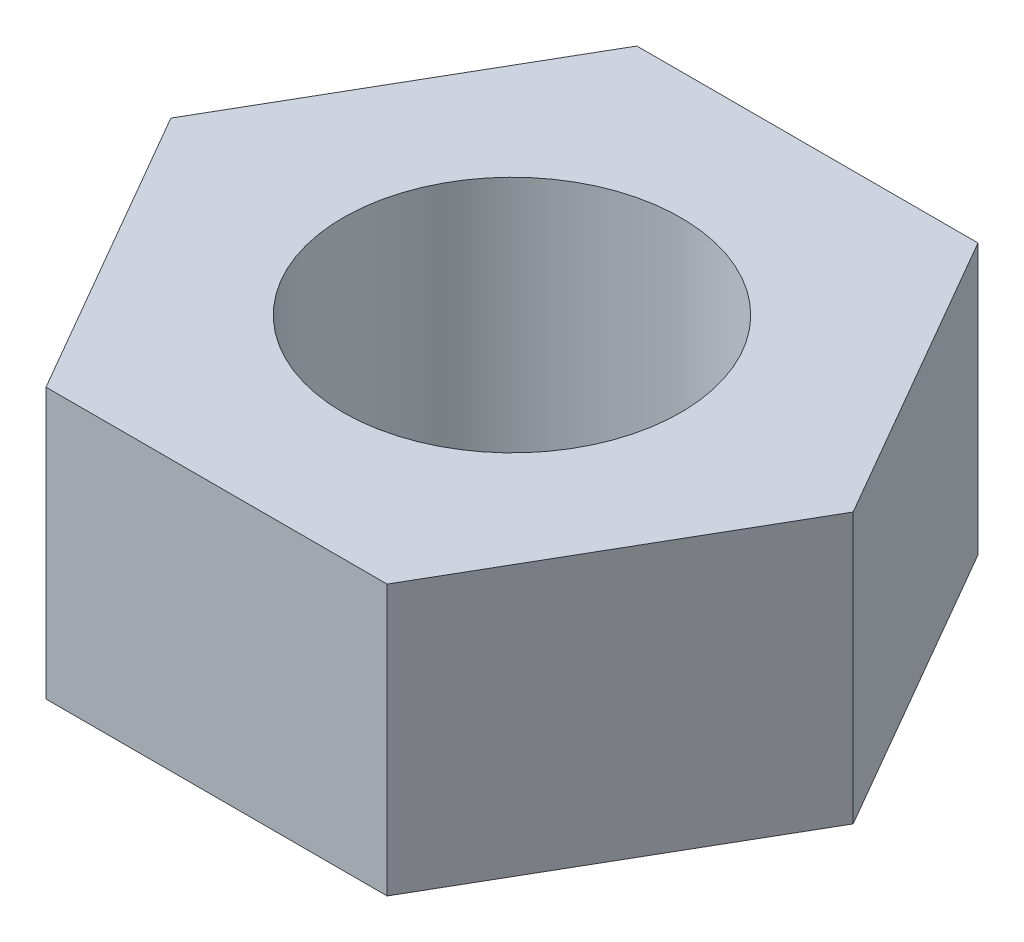
ISO-10303-21;
HEADER;
FILE_DESCRIPTION(('STEP AP214'),'2;1');
FILE_NAME('part.step','',(''),(''),'','','');
FILE_SCHEMA(('AUTOMOTIVE_DESIGN { 1 0 10303 214 1 1 1 1 }'));
ENDSEC;
DATA;
#1=APPLICATION_CONTEXT('core data for automotive mechanical design processes');
#2=APPLICATION_PROTOCOL_DEFINITION('international standard','automotive_design',2000,#1);
#3=PRODUCT_CONTEXT('',#1,'mechanical');
#4=PRODUCT('Part','Part','',(#3));
#5=PRODUCT_RELATED_PRODUCT_CATEGORY('part','',(#4));
#6=PRODUCT_DEFINITION_FORMATION('','',#4);
#7=PRODUCT_DEFINITION_CONTEXT('part definition',#1,'design');
#8=PRODUCT_DEFINITION('design','',#6,#7);
#9=PRODUCT_DEFINITION_SHAPE('','',#8);
#10=(LENGTH_UNIT() NAMED_UNIT(*) SI_UNIT(.MILLI.,.METRE.));
#11=(NAMED_UNIT(*) PLANE_ANGLE_UNIT() SI_UNIT($,.RADIAN.));
#12=(NAMED_UNIT(*) SI_UNIT($,.STERADIAN.) SOLID_ANGLE_UNIT());
#13=UNCERTAINTY_MEASURE_WITH_UNIT(LENGTH_MEASURE(1.E-05),#10,'distance_accuracy_value','');
#14=(GEOMETRIC_REPRESENTATION_CONTEXT(3) GLOBAL_UNCERTAINTY_ASSIGNED_CONTEXT((#13)) GLOBAL_UNIT_ASSIGNED_CONTEXT((#10,
#11,#12)) REPRESENTATION_CONTEXT('',''));
#15=CARTESIAN_POINT('',(0.,0.,0.));
#16=DIRECTION('',(0.,0.,1.));
#17=DIRECTION('',(1.,0.,0.));
#18=AXIS2_PLACEMENT_3D('',#15,#16,#17);
#19=CARTESIAN_POINT('',(0.,3.2,0.));
#20=DIRECTION('',(0.,1.,0.));
#21=DIRECTION('',(0.,0.,1.));
#22=AXIS2_PLACEMENT_3D('',#19,#20,#21);
#23=PLANE('',#22);
#24=DIRECTION('',(0.5,0.,-0.866025403784439));
#25=VECTOR('',#24,1.);
#26=CARTESIAN_POINT('',(2.02072594216369,3.2,3.5));
#27=LINE('',#26,#25);
#28=CARTESIAN_POINT('',(2.02072594216369,3.2,3.5));
#29=VERTEX_POINT('',#28);
#30=CARTESIAN_POINT('',(4.04145188432738,3.2,0.));
#31=VERTEX_POINT('',#30);
#32=EDGE_CURVE('E128',#29,#31,#27,.T.);
#33=ORIENTED_EDGE('',*,*,#32,.T.);
#34=DIRECTION('',(-0.5,0.,-0.866025403784438));
#35=VECTOR('',#34,1.);
#36=CARTESIAN_POINT('',(4.04145188432738,3.2,0.));
#37=LINE('',#36,#35);
#38=CARTESIAN_POINT('',(2.02072594216369,3.2,-3.5));
#39=VERTEX_POINT('',#38);
#40=EDGE_CURVE('E86',#31,#39,#37,.T.);
#41=ORIENTED_EDGE('',*,*,#40,.T.);
#42=DIRECTION('',(-1.,0.,0.));
#43=VECTOR('',#42,1.);
#44=CARTESIAN_POINT('',(2.02072594216369,3.2,-3.5));
#45=LINE('',#44,#43);
#46=CARTESIAN_POINT('',(-2.02072594216369,3.2,-3.5));
#47=VERTEX_POINT('',#46);
#48=EDGE_CURVE('E99',#39,#47,#45,.T.);
#49=ORIENTED_EDGE('',*,*,#48,.T.);
#50=DIRECTION('',(-0.5,0.,0.866025403784439));
#51=VECTOR('',#50,1.);
#52=CARTESIAN_POINT('',(-2.02072594216369,3.2,-3.5));
#53=LINE('',#52,#51);
#54=CARTESIAN_POINT('',(-4.04145188432738,3.2,0.));
#55=VERTEX_POINT('',#54);
#56=EDGE_CURVE('E93',#47,#55,#53,.T.);
#57=ORIENTED_EDGE('',*,*,#56,.T.);
#58=DIRECTION('',(0.5,0.,0.866025403784438));
#59=VECTOR('',#58,1.);
#60=CARTESIAN_POINT('',(-4.04145188432738,3.2,0.));
#61=LINE('',#60,#59);
#62=CARTESIAN_POINT('',(-2.02072594216369,3.2,3.5));
#63=VERTEX_POINT('',#62);
#64=EDGE_CURVE('E97',#55,#63,#61,.T.);
#65=ORIENTED_EDGE('',*,*,#64,.T.);
#66=DIRECTION('',(1.,0.,0.));
#67=VECTOR('',#66,1.);
#68=CARTESIAN_POINT('',(-2.02072594216369,3.2,3.5));
#69=LINE('',#68,#67);
#70=EDGE_CURVE('E49',#63,#29,#69,.T.);
#71=ORIENTED_EDGE('',*,*,#70,.T.);
#72=EDGE_LOOP('',(#33,#41,#49,#57,#65,#71));
#73=FACE_BOUND('',#72,.T.);
#74=CARTESIAN_POINT('',(0.,3.2,0.));
#75=DIRECTION('',(0.,1.,0.));
#76=DIRECTION('',(0.,0.,1.));
#77=AXIS2_PLACEMENT_3D('',#74,#75,#76);
#78=CIRCLE('',#77,2.);
#79=CARTESIAN_POINT('',(0.,3.2,2.));
#80=VERTEX_POINT('',#79);
#81=EDGE_CURVE('E121',#80,#80,#78,.T.);
#82=ORIENTED_EDGE('',*,*,#81,.F.);
#83=EDGE_LOOP('',(#82));
#84=FACE_BOUND('',#83,.T.);
#85=ADVANCED_FACE('F32',(#73,#84),#23,.T.);
#86=CARTESIAN_POINT('',(0.,0.,0.));
#87=DIRECTION('',(0.,1.,0.));
#88=DIRECTION('',(0.,0.,1.));
#89=AXIS2_PLACEMENT_3D('',#86,#87,#88);
#90=PLANE('',#89);
#91=DIRECTION('',(0.5,0.,-0.866025403784439));
#92=VECTOR('',#91,1.);
#93=CARTESIAN_POINT('',(2.02072594216369,0.,3.5));
#94=LINE('',#93,#92);
#95=CARTESIAN_POINT('',(2.02072594216369,0.,3.5));
#96=VERTEX_POINT('',#95);
#97=CARTESIAN_POINT('',(4.04145188432738,0.,0.));
#98=VERTEX_POINT('',#97);
#99=EDGE_CURVE('E117',#96,#98,#94,.T.);
#100=ORIENTED_EDGE('',*,*,#99,.F.);
#101=DIRECTION('',(1.,0.,0.));
#102=VECTOR('',#101,1.);
#103=CARTESIAN_POINT('',(-2.02072594216369,0.,3.5));
#104=LINE('',#103,#102);
#105=CARTESIAN_POINT('',(-2.02072594216369,0.,3.5));
#106=VERTEX_POINT('',#105);
#107=EDGE_CURVE('E78',#106,#96,#104,.T.);
#108=ORIENTED_EDGE('',*,*,#107,.F.);
#109=DIRECTION('',(0.5,0.,0.866025403784438));
#110=VECTOR('',#109,1.);
#111=CARTESIAN_POINT('',(-4.04145188432738,0.,0.));
#112=LINE('',#111,#110);
#113=CARTESIAN_POINT('',(-4.04145188432738,0.,0.));
#114=VERTEX_POINT('',#113);
#115=EDGE_CURVE('E72',#114,#106,#112,.T.);
#116=ORIENTED_EDGE('',*,*,#115,.F.);
#117=DIRECTION('',(-0.5,0.,0.866025403784439));
#118=VECTOR('',#117,1.);
#119=CARTESIAN_POINT('',(-2.02072594216369,0.,-3.5));
#120=LINE('',#119,#118);
#121=CARTESIAN_POINT('',(-2.02072594216369,0.,-3.5));
#122=VERTEX_POINT('',#121);
#123=EDGE_CURVE('E107',#122,#114,#120,.T.);
#124=ORIENTED_EDGE('',*,*,#123,.F.);
#125=DIRECTION('',(-1.,0.,0.));
#126=VECTOR('',#125,1.);
#127=CARTESIAN_POINT('',(2.02072594216369,0.,-3.5));
#128=LINE('',#127,#126);
#129=CARTESIAN_POINT('',(2.02072594216369,0.,-3.5));
#130=VERTEX_POINT('',#129);
#131=EDGE_CURVE('E123',#130,#122,#128,.T.);
#132=ORIENTED_EDGE('',*,*,#131,.F.);
#133=DIRECTION('',(-0.5,0.,-0.866025403784438));
#134=VECTOR('',#133,1.);
#135=CARTESIAN_POINT('',(4.04145188432738,0.,0.));
#136=LINE('',#135,#134);
#137=EDGE_CURVE('E120',#98,#130,#136,.T.);
#138=ORIENTED_EDGE('',*,*,#137,.F.);
#139=EDGE_LOOP('',(#100,#108,#116,#124,#132,#138));
#140=FACE_BOUND('',#139,.T.);
#141=CARTESIAN_POINT('',(0.,0.,0.));
#142=DIRECTION('',(0.,1.,0.));
#143=DIRECTION('',(0.,0.,1.));
#144=AXIS2_PLACEMENT_3D('',#141,#142,#143);
#145=CIRCLE('',#144,2.);
#146=CARTESIAN_POINT('',(0.,0.,2.));
#147=VERTEX_POINT('',#146);
#148=EDGE_CURVE('E221',#147,#147,#145,.T.);
#149=ORIENTED_EDGE('',*,*,#148,.T.);
#150=EDGE_LOOP('',(#149));
#151=FACE_BOUND('',#150,.T.);
#152=ADVANCED_FACE('F137',(#140,#151),#90,.F.);
#153=CARTESIAN_POINT('',(2.02072594216369,3.2,3.5));
#154=DIRECTION('',(-0.866025403784439,0.,-0.5));
#155=DIRECTION('',(-0.5,0.,0.866025403784439));
#156=AXIS2_PLACEMENT_3D('',#153,#154,#155);
#157=PLANE('',#156);
#158=ORIENTED_EDGE('',*,*,#99,.T.);
#159=DIRECTION('',(0.,-1.,0.));
#160=VECTOR('',#159,1.);
#161=CARTESIAN_POINT('',(4.04145188432738,3.2,0.));
#162=LINE('',#161,#160);
#163=EDGE_CURVE('E11',#31,#98,#162,.T.);
#164=ORIENTED_EDGE('',*,*,#163,.F.);
#165=ORIENTED_EDGE('',*,*,#32,.F.);
#166=DIRECTION('',(0.,-1.,0.));
#167=VECTOR('',#166,1.);
#168=CARTESIAN_POINT('',(2.02072594216369,3.2,3.5));
#169=LINE('',#168,#167);
#170=EDGE_CURVE('E113',#29,#96,#169,.T.);
#171=ORIENTED_EDGE('',*,*,#170,.T.);
#172=EDGE_LOOP('',(#158,#164,#165,#171));
#173=FACE_BOUND('',#172,.T.);
#174=ADVANCED_FACE('F34',(#173),#157,.F.);
#175=CARTESIAN_POINT('',(4.04145188432738,3.2,0.));
#176=DIRECTION('',(-0.866025403784438,0.,0.5));
#177=DIRECTION('',(0.5,0.,0.866025403784438));
#178=AXIS2_PLACEMENT_3D('',#175,#176,#177);
#179=PLANE('',#178);
#180=ORIENTED_EDGE('',*,*,#137,.T.);
#181=DIRECTION('',(0.,-1.,0.));
#182=VECTOR('',#181,1.);
#183=CARTESIAN_POINT('',(2.02072594216369,3.2,-3.5));
#184=LINE('',#183,#182);
#185=EDGE_CURVE('E41',#39,#130,#184,.T.);
#186=ORIENTED_EDGE('',*,*,#185,.F.);
#187=ORIENTED_EDGE('',*,*,#40,.F.);
#188=ORIENTED_EDGE('',*,*,#163,.T.);
#189=EDGE_LOOP('',(#180,#186,#187,#188));
#190=FACE_BOUND('',#189,.T.);
#191=ADVANCED_FACE('F162',(#190),#179,.F.);
#192=CARTESIAN_POINT('',(2.02072594216369,3.2,-3.5));
#193=DIRECTION('',(0.,0.,1.));
#194=DIRECTION('',(1.,0.,0.));
#195=AXIS2_PLACEMENT_3D('',#192,#193,#194);
#196=PLANE('',#195);
#197=ORIENTED_EDGE('',*,*,#131,.T.);
#198=DIRECTION('',(0.,-1.,0.));
#199=VECTOR('',#198,1.);
#200=CARTESIAN_POINT('',(-2.02072594216369,3.2,-3.5));
#201=LINE('',#200,#199);
#202=EDGE_CURVE('E108',#47,#122,#201,.T.);
#203=ORIENTED_EDGE('',*,*,#202,.F.);
#204=ORIENTED_EDGE('',*,*,#48,.F.);
#205=ORIENTED_EDGE('',*,*,#185,.T.);
#206=EDGE_LOOP('',(#197,#203,#204,#205));
#207=FACE_BOUND('',#206,.T.);
#208=ADVANCED_FACE('F134',(#207),#196,.F.);
#209=CARTESIAN_POINT('',(-2.02072594216369,3.2,-3.5));
#210=DIRECTION('',(0.866025403784439,0.,0.5));
#211=DIRECTION('',(0.5,0.,-0.866025403784439));
#212=AXIS2_PLACEMENT_3D('',#209,#210,#211);
#213=PLANE('',#212);
#214=ORIENTED_EDGE('',*,*,#123,.T.);
#215=DIRECTION('',(0.,-1.,0.));
#216=VECTOR('',#215,1.);
#217=CARTESIAN_POINT('',(-4.04145188432738,3.2,0.));
#218=LINE('',#217,#216);
#219=EDGE_CURVE('E104',#55,#114,#218,.T.);
#220=ORIENTED_EDGE('',*,*,#219,.F.);
#221=ORIENTED_EDGE('',*,*,#56,.F.);
#222=ORIENTED_EDGE('',*,*,#202,.T.);
#223=EDGE_LOOP('',(#214,#220,#221,#222));
#224=FACE_BOUND('',#223,.T.);
#225=ADVANCED_FACE('F105',(#224),#213,.F.);
#226=CARTESIAN_POINT('',(-4.04145188432738,3.2,0.));
#227=DIRECTION('',(0.866025403784438,0.,-0.5));
#228=DIRECTION('',(-0.5,0.,-0.866025403784438));
#229=AXIS2_PLACEMENT_3D('',#226,#227,#228);
#230=PLANE('',#229);
#231=ORIENTED_EDGE('',*,*,#115,.T.);
#232=DIRECTION('',(0.,-1.,0.));
#233=VECTOR('',#232,1.);
#234=CARTESIAN_POINT('',(-2.02072594216369,3.2,3.5));
#235=LINE('',#234,#233);
#236=EDGE_CURVE('E109',#63,#106,#235,.T.);
#237=ORIENTED_EDGE('',*,*,#236,.F.);
#238=ORIENTED_EDGE('',*,*,#64,.F.);
#239=ORIENTED_EDGE('',*,*,#219,.T.);
#240=EDGE_LOOP('',(#231,#237,#238,#239));
#241=FACE_BOUND('',#240,.T.);
#242=ADVANCED_FACE('F111',(#241),#230,.F.);
#243=CARTESIAN_POINT('',(-2.02072594216369,3.2,3.5));
#244=DIRECTION('',(0.,0.,-1.));
#245=DIRECTION('',(-1.,0.,0.));
#246=AXIS2_PLACEMENT_3D('',#243,#244,#245);
#247=PLANE('',#246);
#248=ORIENTED_EDGE('',*,*,#107,.T.);
#249=ORIENTED_EDGE('',*,*,#170,.F.);
#250=ORIENTED_EDGE('',*,*,#70,.F.);
#251=ORIENTED_EDGE('',*,*,#236,.T.);
#252=EDGE_LOOP('',(#248,#249,#250,#251));
#253=FACE_BOUND('',#252,.T.);
#254=ADVANCED_FACE('F142',(#253),#247,.F.);
#255=CARTESIAN_POINT('',(0.,3.2,0.));
#256=DIRECTION('',(0.,-1.,0.));
#257=DIRECTION('',(0.,0.,-1.));
#258=AXIS2_PLACEMENT_3D('',#255,#256,#257);
#259=CYLINDRICAL_SURFACE('',#258,2.);
#260=ORIENTED_EDGE('',*,*,#81,.T.);
#261=EDGE_LOOP('',(#260));
#262=FACE_BOUND('',#261,.T.);
#263=ORIENTED_EDGE('',*,*,#148,.F.);
#264=EDGE_LOOP('',(#263));
#265=FACE_BOUND('',#264,.T.);
#266=ADVANCED_FACE('F144',(#262,#265),#259,.F.);
#267=CLOSED_SHELL('',(#85,#152,#174,#191,#208,#225,#242,#254,#266));
#268=MANIFOLD_SOLID_BREP('B2',#267);
#269=ADVANCED_BREP_SHAPE_REPRESENTATION('',(#18,#268),#14);
#270=SHAPE_DEFINITION_REPRESENTATION(#9,#269);
ENDSEC;
END-ISO-10303-21;
